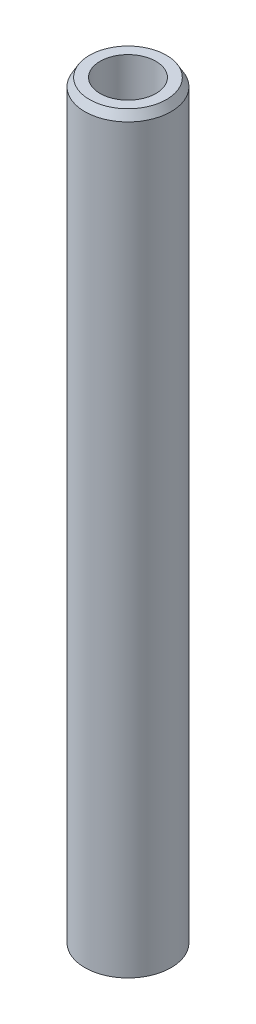
ISO-10303-21;
HEADER;
FILE_DESCRIPTION(('STEP AP214'),'2;1');
FILE_NAME('part.step','',(''),(''),'','','');
FILE_SCHEMA(('AUTOMOTIVE_DESIGN { 1 0 10303 214 1 1 1 1 }'));
ENDSEC;
DATA;
#1=APPLICATION_CONTEXT('core data for automotive mechanical design processes');
#2=APPLICATION_PROTOCOL_DEFINITION('international standard','automotive_design',2000,#1);
#3=PRODUCT_CONTEXT('',#1,'mechanical');
#4=PRODUCT('Part','Part','',(#3));
#5=PRODUCT_RELATED_PRODUCT_CATEGORY('part','',(#4));
#6=PRODUCT_DEFINITION_FORMATION('','',#4);
#7=PRODUCT_DEFINITION_CONTEXT('part definition',#1,'design');
#8=PRODUCT_DEFINITION('design','',#6,#7);
#9=PRODUCT_DEFINITION_SHAPE('','',#8);
#10=(LENGTH_UNIT() NAMED_UNIT(*) SI_UNIT(.MILLI.,.METRE.));
#11=(NAMED_UNIT(*) PLANE_ANGLE_UNIT() SI_UNIT($,.RADIAN.));
#12=(NAMED_UNIT(*) SI_UNIT($,.STERADIAN.) SOLID_ANGLE_UNIT());
#13=UNCERTAINTY_MEASURE_WITH_UNIT(LENGTH_MEASURE(1.E-05),#10,'distance_accuracy_value','');
#14=(GEOMETRIC_REPRESENTATION_CONTEXT(3) GLOBAL_UNCERTAINTY_ASSIGNED_CONTEXT((#13)) GLOBAL_UNIT_ASSIGNED_CONTEXT((#10,
#11,#12)) REPRESENTATION_CONTEXT('',''));
#15=CARTESIAN_POINT('',(0.,0.,0.));
#16=DIRECTION('',(0.,0.,1.));
#17=DIRECTION('',(1.,0.,0.));
#18=AXIS2_PLACEMENT_3D('',#15,#16,#17);
#19=CARTESIAN_POINT('',(0.,393.426691268331,0.));
#20=DIRECTION('',(0.,-1.,0.));
#21=DIRECTION('',(0.,0.,-1.));
#22=AXIS2_PLACEMENT_3D('',#19,#20,#21);
#23=CYLINDRICAL_SURFACE('',#22,22.5);
#24=CARTESIAN_POINT('',(0.,389.191491728291,0.));
#25=DIRECTION('',(0.,1.,0.));
#26=DIRECTION('',(0.,0.,1.));
#27=AXIS2_PLACEMENT_3D('',#24,#25,#26);
#28=CIRCLE('',#27,22.5);
#29=CARTESIAN_POINT('',(0.,389.191491728291,22.5));
#30=VERTEX_POINT('',#29);
#31=EDGE_CURVE('E50',#30,#30,#28,.F.);
#32=ORIENTED_EDGE('',*,*,#31,.T.);
#33=EDGE_LOOP('',(#32));
#34=FACE_BOUND('',#33,.T.);
#35=CARTESIAN_POINT('',(0.,2.44519359451417,0.));
#36=DIRECTION('',(0.,1.,0.));
#37=DIRECTION('',(0.,0.,1.));
#38=AXIS2_PLACEMENT_3D('',#35,#36,#37);
#39=CIRCLE('',#38,22.5);
#40=CARTESIAN_POINT('',(0.,2.44519359451417,22.5));
#41=VERTEX_POINT('',#40);
#42=EDGE_CURVE('E51',#41,#41,#39,.T.);
#43=ORIENTED_EDGE('',*,*,#42,.T.);
#44=EDGE_LOOP('',(#43));
#45=FACE_BOUND('',#44,.T.);
#46=ADVANCED_FACE('F39',(#34,#45),#23,.T.);
#47=CARTESIAN_POINT('',(0.,393.426691268331,0.));
#48=DIRECTION('',(0.,1.,0.));
#49=DIRECTION('',(0.,0.,1.));
#50=AXIS2_PLACEMENT_3D('',#47,#48,#49);
#51=PLANE('',#50);
#52=CARTESIAN_POINT('',(0.,393.426691268331,0.));
#53=DIRECTION('',(0.,1.,0.));
#54=DIRECTION('',(0.,0.,1.));
#55=AXIS2_PLACEMENT_3D('',#52,#53,#54);
#56=CIRCLE('',#55,20.0548064054859);
#57=CARTESIAN_POINT('',(0.,393.426691268331,20.0548064054859));
#58=VERTEX_POINT('',#57);
#59=EDGE_CURVE('E54',#58,#58,#56,.T.);
#60=ORIENTED_EDGE('',*,*,#59,.T.);
#61=EDGE_LOOP('',(#60));
#62=FACE_BOUND('',#61,.T.);
#63=CARTESIAN_POINT('',(0.,393.426691268331,0.));
#64=DIRECTION('',(0.,1.,0.));
#65=DIRECTION('',(0.,0.,1.));
#66=AXIS2_PLACEMENT_3D('',#63,#64,#65);
#67=CIRCLE('',#66,14.5707552871755);
#68=CARTESIAN_POINT('',(0.,393.426691268331,14.5707552871755));
#69=VERTEX_POINT('',#68);
#70=EDGE_CURVE('E58',#69,#69,#67,.T.);
#71=ORIENTED_EDGE('',*,*,#70,.F.);
#72=EDGE_LOOP('',(#71));
#73=FACE_BOUND('',#72,.T.);
#74=ADVANCED_FACE('F69',(#62,#73),#51,.T.);
#75=CARTESIAN_POINT('',(0.,0.,0.));
#76=DIRECTION('',(0.,1.,0.));
#77=DIRECTION('',(0.,0.,1.));
#78=AXIS2_PLACEMENT_3D('',#75,#76,#77);
#79=PLANE('',#78);
#80=CARTESIAN_POINT('',(0.,0.,0.));
#81=DIRECTION('',(0.,1.,0.));
#82=DIRECTION('',(0.,0.,1.));
#83=AXIS2_PLACEMENT_3D('',#80,#81,#82);
#84=CIRCLE('',#83,18.2648004599594);
#85=CARTESIAN_POINT('',(0.,0.,18.2648004599594));
#86=VERTEX_POINT('',#85);
#87=EDGE_CURVE('E10',#86,#86,#84,.F.);
#88=ORIENTED_EDGE('',*,*,#87,.T.);
#89=EDGE_LOOP('',(#88));
#90=FACE_BOUND('',#89,.T.);
#91=CARTESIAN_POINT('',(0.,0.,0.));
#92=DIRECTION('',(0.,1.,0.));
#93=DIRECTION('',(0.,0.,1.));
#94=AXIS2_PLACEMENT_3D('',#91,#92,#93);
#95=CIRCLE('',#94,14.5707552871755);
#96=CARTESIAN_POINT('',(0.,0.,14.5707552871755));
#97=VERTEX_POINT('',#96);
#98=EDGE_CURVE('E63',#97,#97,#95,.T.);
#99=ORIENTED_EDGE('',*,*,#98,.T.);
#100=EDGE_LOOP('',(#99));
#101=FACE_BOUND('',#100,.T.);
#102=ADVANCED_FACE('F75',(#90,#101),#79,.F.);
#103=CARTESIAN_POINT('',(0.,393.426691268331,0.));
#104=DIRECTION('',(0.,-1.,0.));
#105=DIRECTION('',(0.,0.,-1.));
#106=AXIS2_PLACEMENT_3D('',#103,#104,#105);
#107=CYLINDRICAL_SURFACE('',#106,14.5707552871755);
#108=ORIENTED_EDGE('',*,*,#70,.T.);
#109=EDGE_LOOP('',(#108));
#110=FACE_BOUND('',#109,.T.);
#111=ORIENTED_EDGE('',*,*,#98,.F.);
#112=EDGE_LOOP('',(#111));
#113=FACE_BOUND('',#112,.T.);
#114=ADVANCED_FACE('F70',(#110,#113),#107,.F.);
#115=CARTESIAN_POINT('',(0.,393.426691268331,0.));
#116=DIRECTION('',(0.,-1.,0.));
#117=DIRECTION('',(0.,0.,-1.));
#118=AXIS2_PLACEMENT_3D('',#115,#116,#117);
#119=CONICAL_SURFACE('',#118,20.0548064054859,0.523598775598295);
#120=ORIENTED_EDGE('',*,*,#31,.F.);
#121=EDGE_LOOP('',(#120));
#122=FACE_BOUND('',#121,.T.);
#123=ORIENTED_EDGE('',*,*,#59,.F.);
#124=EDGE_LOOP('',(#123));
#125=FACE_BOUND('',#124,.T.);
#126=ADVANCED_FACE('F81',(#122,#125),#119,.T.);
#127=CARTESIAN_POINT('',(0.,2.44519359451417,0.));
#128=DIRECTION('',(0.,1.,0.));
#129=DIRECTION('',(0.,0.,1.));
#130=AXIS2_PLACEMENT_3D('',#127,#128,#129);
#131=CONICAL_SURFACE('',#130,22.5,1.0471975511966);
#132=ORIENTED_EDGE('',*,*,#87,.F.);
#133=EDGE_LOOP('',(#132));
#134=FACE_BOUND('',#133,.T.);
#135=ORIENTED_EDGE('',*,*,#42,.F.);
#136=EDGE_LOOP('',(#135));
#137=FACE_BOUND('',#136,.T.);
#138=ADVANCED_FACE('F45',(#134,#137),#131,.T.);
#139=CLOSED_SHELL('',(#46,#74,#102,#114,#126,#138));
#140=MANIFOLD_SOLID_BREP('B2',#139);
#141=ADVANCED_BREP_SHAPE_REPRESENTATION('',(#18,#140),#14);
#142=SHAPE_DEFINITION_REPRESENTATION(#9,#141);
ENDSEC;
END-ISO-10303-21;
